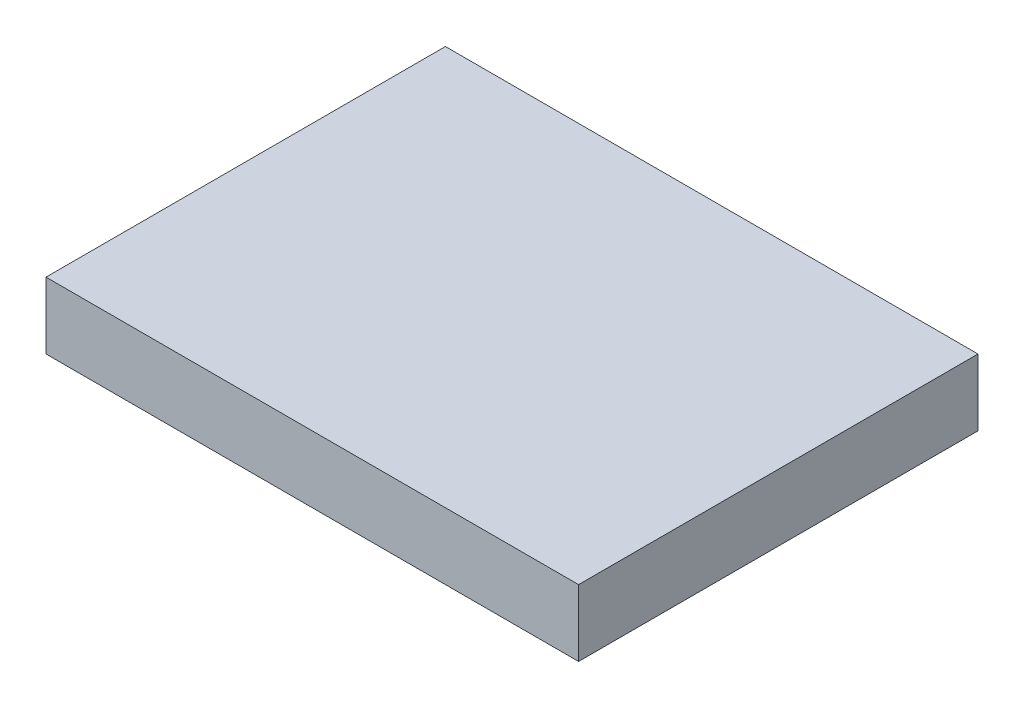
ISO-10303-21;
HEADER;
FILE_DESCRIPTION(('STEP AP214'),'2;1');
FILE_NAME('part.step','',(''),(''),'','','');
FILE_SCHEMA(('AUTOMOTIVE_DESIGN { 1 0 10303 214 1 1 1 1 }'));
ENDSEC;
DATA;
#1=APPLICATION_CONTEXT('core data for automotive mechanical design processes');
#2=APPLICATION_PROTOCOL_DEFINITION('international standard','automotive_design',2000,#1);
#3=PRODUCT_CONTEXT('',#1,'mechanical');
#4=PRODUCT('Part','Part','',(#3));
#5=PRODUCT_RELATED_PRODUCT_CATEGORY('part','',(#4));
#6=PRODUCT_DEFINITION_FORMATION('','',#4);
#7=PRODUCT_DEFINITION_CONTEXT('part definition',#1,'design');
#8=PRODUCT_DEFINITION('design','',#6,#7);
#9=PRODUCT_DEFINITION_SHAPE('','',#8);
#10=(LENGTH_UNIT() NAMED_UNIT(*) SI_UNIT(.MILLI.,.METRE.));
#11=(NAMED_UNIT(*) PLANE_ANGLE_UNIT() SI_UNIT($,.RADIAN.));
#12=(NAMED_UNIT(*) SI_UNIT($,.STERADIAN.) SOLID_ANGLE_UNIT());
#13=UNCERTAINTY_MEASURE_WITH_UNIT(LENGTH_MEASURE(1.E-05),#10,'distance_accuracy_value','');
#14=(GEOMETRIC_REPRESENTATION_CONTEXT(3) GLOBAL_UNCERTAINTY_ASSIGNED_CONTEXT((#13)) GLOBAL_UNIT_ASSIGNED_CONTEXT((#10,
#11,#12)) REPRESENTATION_CONTEXT('',''));
#15=CARTESIAN_POINT('',(0.,0.,0.));
#16=DIRECTION('',(0.,0.,1.));
#17=DIRECTION('',(1.,0.,0.));
#18=AXIS2_PLACEMENT_3D('',#15,#16,#17);
#19=CARTESIAN_POINT('',(25.6,1.52,14.56));
#20=DIRECTION('',(0.,-1.,0.));
#21=DIRECTION('',(0.,0.,-1.));
#22=AXIS2_PLACEMENT_3D('',#19,#20,#21);
#23=PLANE('',#22);
#24=DIRECTION('',(0.,0.,-1.));
#25=VECTOR('',#24,1.);
#26=CARTESIAN_POINT('',(26.4,1.52,14.26));
#27=LINE('',#26,#25);
#28=CARTESIAN_POINT('',(26.4,1.52,14.56));
#29=VERTEX_POINT('',#28);
#30=CARTESIAN_POINT('',(26.4,1.52,13.96));
#31=VERTEX_POINT('',#30);
#32=EDGE_CURVE('E68',#29,#31,#27,.T.);
#33=ORIENTED_EDGE('',*,*,#32,.F.);
#34=DIRECTION('',(1.,0.,0.));
#35=VECTOR('',#34,1.);
#36=CARTESIAN_POINT('',(25.6,1.52,14.56));
#37=LINE('',#36,#35);
#38=CARTESIAN_POINT('',(25.6,1.52,14.56));
#39=VERTEX_POINT('',#38);
#40=EDGE_CURVE('E55',#39,#29,#37,.T.);
#41=ORIENTED_EDGE('',*,*,#40,.F.);
#42=DIRECTION('',(0.,0.,-1.));
#43=VECTOR('',#42,1.);
#44=CARTESIAN_POINT('',(25.6,1.52,14.26));
#45=LINE('',#44,#43);
#46=CARTESIAN_POINT('',(25.6,1.52,13.96));
#47=VERTEX_POINT('',#46);
#48=EDGE_CURVE('E20',#39,#47,#45,.T.);
#49=ORIENTED_EDGE('',*,*,#48,.T.);
#50=DIRECTION('',(-1.,0.,0.));
#51=VECTOR('',#50,1.);
#52=CARTESIAN_POINT('',(25.6,1.52,13.96));
#53=LINE('',#52,#51);
#54=EDGE_CURVE('E81',#31,#47,#53,.T.);
#55=ORIENTED_EDGE('',*,*,#54,.F.);
#56=EDGE_LOOP('',(#33,#41,#49,#55));
#57=FACE_BOUND('',#56,.T.);
#58=ADVANCED_FACE('F17',(#57),#23,.T.);
#59=CARTESIAN_POINT('',(25.6,1.57,14.26));
#60=DIRECTION('',(1.,0.,0.));
#61=DIRECTION('',(0.,0.,-1.));
#62=AXIS2_PLACEMENT_3D('',#59,#60,#61);
#63=PLANE('',#62);
#64=DIRECTION('',(0.,0.,1.));
#65=VECTOR('',#64,1.);
#66=CARTESIAN_POINT('',(25.6,1.62,13.96));
#67=LINE('',#66,#65);
#68=CARTESIAN_POINT('',(25.6,1.62,13.96));
#69=VERTEX_POINT('',#68);
#70=CARTESIAN_POINT('',(25.6,1.62,14.56));
#71=VERTEX_POINT('',#70);
#72=EDGE_CURVE('E83',#69,#71,#67,.T.);
#73=ORIENTED_EDGE('',*,*,#72,.F.);
#74=DIRECTION('',(0.,1.,0.));
#75=VECTOR('',#74,1.);
#76=CARTESIAN_POINT('',(25.6,1.52,13.96));
#77=LINE('',#76,#75);
#78=EDGE_CURVE('E64',#47,#69,#77,.T.);
#79=ORIENTED_EDGE('',*,*,#78,.F.);
#80=ORIENTED_EDGE('',*,*,#48,.F.);
#81=DIRECTION('',(0.,1.,0.));
#82=VECTOR('',#81,1.);
#83=CARTESIAN_POINT('',(25.6,1.62,14.56));
#84=LINE('',#83,#82);
#85=EDGE_CURVE('E61',#71,#39,#84,.F.);
#86=ORIENTED_EDGE('',*,*,#85,.F.);
#87=EDGE_LOOP('',(#73,#79,#80,#86));
#88=FACE_BOUND('',#87,.T.);
#89=ADVANCED_FACE('F60',(#88),#63,.F.);
#90=CARTESIAN_POINT('',(25.6,1.62,14.56));
#91=DIRECTION('',(0.,0.,1.));
#92=DIRECTION('',(1.,0.,0.));
#93=AXIS2_PLACEMENT_3D('',#90,#91,#92);
#94=PLANE('',#93);
#95=DIRECTION('',(0.,1.,0.));
#96=VECTOR('',#95,1.);
#97=CARTESIAN_POINT('',(26.4,1.57,14.56));
#98=LINE('',#97,#96);
#99=CARTESIAN_POINT('',(26.4,1.62,14.56));
#100=VERTEX_POINT('',#99);
#101=EDGE_CURVE('E70',#100,#29,#98,.F.);
#102=ORIENTED_EDGE('',*,*,#101,.F.);
#103=DIRECTION('',(1.,0.,0.));
#104=VECTOR('',#103,1.);
#105=CARTESIAN_POINT('',(25.6,1.62,14.56));
#106=LINE('',#105,#104);
#107=EDGE_CURVE('E74',#71,#100,#106,.T.);
#108=ORIENTED_EDGE('',*,*,#107,.F.);
#109=ORIENTED_EDGE('',*,*,#85,.T.);
#110=ORIENTED_EDGE('',*,*,#40,.T.);
#111=EDGE_LOOP('',(#102,#108,#109,#110));
#112=FACE_BOUND('',#111,.T.);
#113=ADVANCED_FACE('F72',(#112),#94,.T.);
#114=CARTESIAN_POINT('',(26.4,1.57,14.26));
#115=DIRECTION('',(1.,0.,0.));
#116=DIRECTION('',(0.,0.,-1.));
#117=AXIS2_PLACEMENT_3D('',#114,#115,#116);
#118=PLANE('',#117);
#119=DIRECTION('',(0.,1.,0.));
#120=VECTOR('',#119,1.);
#121=CARTESIAN_POINT('',(26.4,1.52,13.96));
#122=LINE('',#121,#120);
#123=CARTESIAN_POINT('',(26.4,1.62,13.96));
#124=VERTEX_POINT('',#123);
#125=EDGE_CURVE('E35',#124,#31,#122,.F.);
#126=ORIENTED_EDGE('',*,*,#125,.F.);
#127=DIRECTION('',(0.,0.,1.));
#128=VECTOR('',#127,1.);
#129=CARTESIAN_POINT('',(26.4,1.62,13.96));
#130=LINE('',#129,#128);
#131=EDGE_CURVE('E26',#100,#124,#130,.F.);
#132=ORIENTED_EDGE('',*,*,#131,.F.);
#133=ORIENTED_EDGE('',*,*,#101,.T.);
#134=ORIENTED_EDGE('',*,*,#32,.T.);
#135=EDGE_LOOP('',(#126,#132,#133,#134));
#136=FACE_BOUND('',#135,.T.);
#137=ADVANCED_FACE('F89',(#136),#118,.T.);
#138=CARTESIAN_POINT('',(25.6,1.52,13.96));
#139=DIRECTION('',(0.,0.,-1.));
#140=DIRECTION('',(-1.,0.,0.));
#141=AXIS2_PLACEMENT_3D('',#138,#139,#140);
#142=PLANE('',#141);
#143=ORIENTED_EDGE('',*,*,#125,.T.);
#144=ORIENTED_EDGE('',*,*,#54,.T.);
#145=ORIENTED_EDGE('',*,*,#78,.T.);
#146=DIRECTION('',(1.,0.,0.));
#147=VECTOR('',#146,1.);
#148=CARTESIAN_POINT('',(25.6,1.62,13.96));
#149=LINE('',#148,#147);
#150=EDGE_CURVE('E11',#124,#69,#149,.F.);
#151=ORIENTED_EDGE('',*,*,#150,.F.);
#152=EDGE_LOOP('',(#143,#144,#145,#151));
#153=FACE_BOUND('',#152,.T.);
#154=ADVANCED_FACE('F91',(#153),#142,.T.);
#155=CARTESIAN_POINT('',(25.6,1.62,13.96));
#156=DIRECTION('',(0.,1.,0.));
#157=DIRECTION('',(0.,0.,1.));
#158=AXIS2_PLACEMENT_3D('',#155,#156,#157);
#159=PLANE('',#158);
#160=ORIENTED_EDGE('',*,*,#131,.T.);
#161=ORIENTED_EDGE('',*,*,#150,.T.);
#162=ORIENTED_EDGE('',*,*,#72,.T.);
#163=ORIENTED_EDGE('',*,*,#107,.T.);
#164=EDGE_LOOP('',(#160,#161,#162,#163));
#165=FACE_BOUND('',#164,.T.);
#166=ADVANCED_FACE('F88',(#165),#159,.T.);
#167=CLOSED_SHELL('',(#58,#89,#113,#137,#154,#166));
#168=MANIFOLD_SOLID_BREP('B1',#167);
#169=ADVANCED_BREP_SHAPE_REPRESENTATION('',(#18,#168),#14);
#170=SHAPE_DEFINITION_REPRESENTATION(#9,#169);
ENDSEC;
END-ISO-10303-21;
